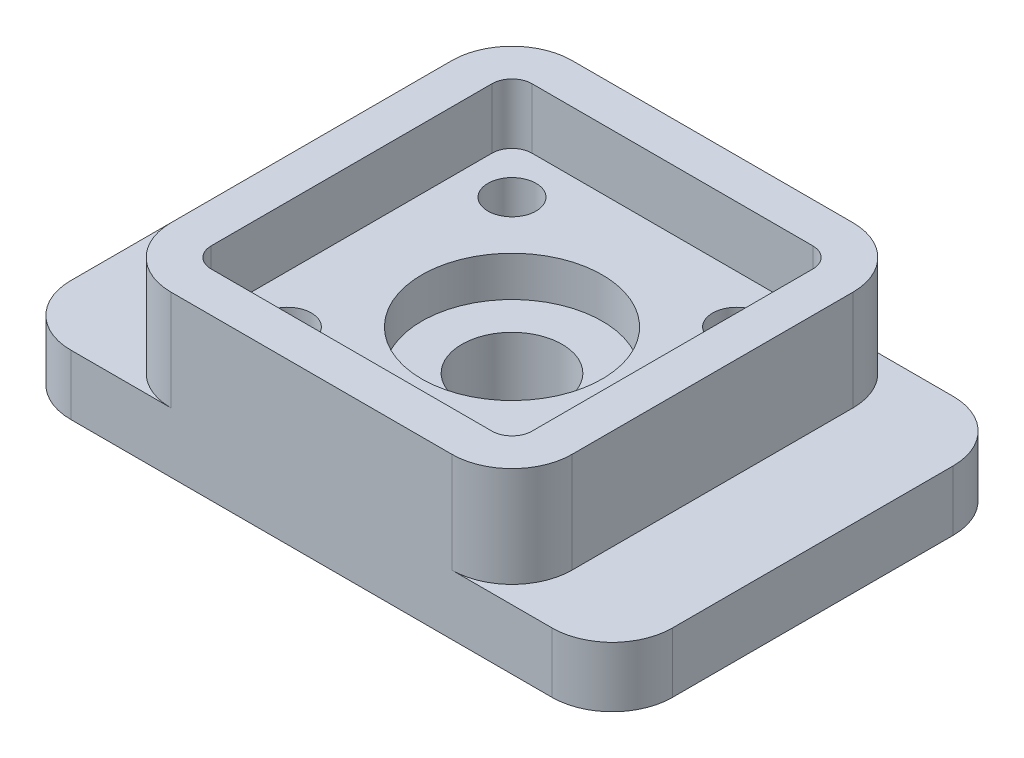
ISO-10303-21;
HEADER;
FILE_DESCRIPTION(('STEP AP214'),'2;1');
FILE_NAME('part.step','',(''),(''),'','','');
FILE_SCHEMA(('AUTOMOTIVE_DESIGN { 1 0 10303 214 1 1 1 1 }'));
ENDSEC;
DATA;
#1=APPLICATION_CONTEXT('core data for automotive mechanical design processes');
#2=APPLICATION_PROTOCOL_DEFINITION('international standard','automotive_design',2000,#1);
#3=PRODUCT_CONTEXT('',#1,'mechanical');
#4=PRODUCT('Part','Part','',(#3));
#5=PRODUCT_RELATED_PRODUCT_CATEGORY('part','',(#4));
#6=PRODUCT_DEFINITION_FORMATION('','',#4);
#7=PRODUCT_DEFINITION_CONTEXT('part definition',#1,'design');
#8=PRODUCT_DEFINITION('design','',#6,#7);
#9=PRODUCT_DEFINITION_SHAPE('','',#8);
#10=(LENGTH_UNIT() NAMED_UNIT(*) SI_UNIT(.MILLI.,.METRE.));
#11=(NAMED_UNIT(*) PLANE_ANGLE_UNIT() SI_UNIT($,.RADIAN.));
#12=(NAMED_UNIT(*) SI_UNIT($,.STERADIAN.) SOLID_ANGLE_UNIT());
#13=UNCERTAINTY_MEASURE_WITH_UNIT(LENGTH_MEASURE(1.E-05),#10,'distance_accuracy_value','');
#14=(GEOMETRIC_REPRESENTATION_CONTEXT(3) GLOBAL_UNCERTAINTY_ASSIGNED_CONTEXT((#13)) GLOBAL_UNIT_ASSIGNED_CONTEXT((#10,
#11,#12)) REPRESENTATION_CONTEXT('',''));
#15=CARTESIAN_POINT('',(0.,0.,0.));
#16=DIRECTION('',(0.,0.,1.));
#17=DIRECTION('',(1.,0.,0.));
#18=AXIS2_PLACEMENT_3D('',#15,#16,#17);
#19=CARTESIAN_POINT('',(-60.,15.,-35.));
#20=DIRECTION('',(0.,1.,0.));
#21=DIRECTION('',(0.,0.,1.));
#22=AXIS2_PLACEMENT_3D('',#19,#20,#21);
#23=PLANE('',#22);
#24=CARTESIAN_POINT('',(0.,15.,0.));
#25=DIRECTION('',(0.,1.,0.));
#26=DIRECTION('',(0.,0.,1.));
#27=AXIS2_PLACEMENT_3D('',#24,#25,#26);
#28=CIRCLE('',#27,22.5);
#29=CARTESIAN_POINT('',(0.,15.,22.5));
#30=VERTEX_POINT('',#29);
#31=EDGE_CURVE('E11',#30,#30,#28,.F.);
#32=ORIENTED_EDGE('',*,*,#31,.F.);
#33=EDGE_LOOP('',(#32));
#34=FACE_BOUND('',#33,.T.);
#35=CARTESIAN_POINT('',(0.,15.,0.));
#36=DIRECTION('',(0.,1.,0.));
#37=DIRECTION('',(0.,0.,1.));
#38=AXIS2_PLACEMENT_3D('',#35,#36,#37);
#39=CIRCLE('',#38,12.5);
#40=CARTESIAN_POINT('',(0.,15.,12.5));
#41=VERTEX_POINT('',#40);
#42=EDGE_CURVE('E342',#41,#41,#39,.T.);
#43=ORIENTED_EDGE('',*,*,#42,.F.);
#44=EDGE_LOOP('',(#43));
#45=FACE_BOUND('',#44,.T.);
#46=ADVANCED_FACE('F35',(#34,#45),#23,.T.);
#47=DIRECTION('',(0.,0.,-1.));
#48=VECTOR('',#47,1.);
#49=CARTESIAN_POINT('',(-50.,15.,-35.));
#50=LINE('',#49,#48);
#51=CARTESIAN_POINT('',(-50.,15.,35.));
#52=VERTEX_POINT('',#51);
#53=CARTESIAN_POINT('',(-50.,15.,-35.));
#54=VERTEX_POINT('',#53);
#55=EDGE_CURVE('E316',#52,#54,#50,.T.);
#56=ORIENTED_EDGE('',*,*,#55,.T.);
#57=CARTESIAN_POINT('',(-35.,15.,-35.));
#58=DIRECTION('',(0.,1.,0.));
#59=DIRECTION('',(0.,0.,1.));
#60=AXIS2_PLACEMENT_3D('',#57,#58,#59);
#61=CIRCLE('',#60,15.);
#62=CARTESIAN_POINT('',(-35.,15.,-50.));
#63=VERTEX_POINT('',#62);
#64=EDGE_CURVE('E301',#54,#63,#61,.F.);
#65=ORIENTED_EDGE('',*,*,#64,.T.);
#66=DIRECTION('',(-1.,0.,0.));
#67=VECTOR('',#66,1.);
#68=CARTESIAN_POINT('',(60.,15.,-50.));
#69=LINE('',#68,#67);
#70=CARTESIAN_POINT('',(-60.,15.,-50.));
#71=VERTEX_POINT('',#70);
#72=EDGE_CURVE('E366',#63,#71,#69,.T.);
#73=ORIENTED_EDGE('',*,*,#72,.T.);
#74=CARTESIAN_POINT('',(-60.,15.,-35.));
#75=DIRECTION('',(0.,1.,0.));
#76=DIRECTION('',(0.,0.,1.));
#77=AXIS2_PLACEMENT_3D('',#74,#75,#76);
#78=CIRCLE('',#77,15.);
#79=CARTESIAN_POINT('',(-75.,15.,-34.9999999999999));
#80=VERTEX_POINT('',#79);
#81=EDGE_CURVE('E348',#71,#80,#78,.T.);
#82=ORIENTED_EDGE('',*,*,#81,.T.);
#83=DIRECTION('',(0.,0.,1.));
#84=VECTOR('',#83,1.);
#85=CARTESIAN_POINT('',(-75.,15.,-34.9999999999999));
#86=LINE('',#85,#84);
#87=CARTESIAN_POINT('',(-75.,15.,35.));
#88=VERTEX_POINT('',#87);
#89=EDGE_CURVE('E351',#80,#88,#86,.T.);
#90=ORIENTED_EDGE('',*,*,#89,.T.);
#91=CARTESIAN_POINT('',(-60.,15.,35.));
#92=DIRECTION('',(0.,1.,0.));
#93=DIRECTION('',(0.,0.,1.));
#94=AXIS2_PLACEMENT_3D('',#91,#92,#93);
#95=CIRCLE('',#94,15.);
#96=CARTESIAN_POINT('',(-60.,15.,50.));
#97=VERTEX_POINT('',#96);
#98=EDGE_CURVE('E354',#88,#97,#95,.T.);
#99=ORIENTED_EDGE('',*,*,#98,.T.);
#100=DIRECTION('',(1.,0.,0.));
#101=VECTOR('',#100,1.);
#102=CARTESIAN_POINT('',(-60.,15.,50.));
#103=LINE('',#102,#101);
#104=CARTESIAN_POINT('',(-35.,15.,50.));
#105=VERTEX_POINT('',#104);
#106=EDGE_CURVE('E357',#97,#105,#103,.T.);
#107=ORIENTED_EDGE('',*,*,#106,.T.);
#108=CARTESIAN_POINT('',(-35.,15.,35.));
#109=DIRECTION('',(0.,1.,0.));
#110=DIRECTION('',(0.,0.,1.));
#111=AXIS2_PLACEMENT_3D('',#108,#109,#110);
#112=CIRCLE('',#111,15.);
#113=EDGE_CURVE('E310',#105,#52,#112,.F.);
#114=ORIENTED_EDGE('',*,*,#113,.T.);
#115=EDGE_LOOP('',(#56,#65,#73,#82,#90,#99,#107,#114));
#116=FACE_BOUND('',#115,.T.);
#117=ADVANCED_FACE('F438',(#116),#23,.T.);
#118=CARTESIAN_POINT('',(60.,15.,-50.));
#119=VERTEX_POINT('',#118);
#120=CARTESIAN_POINT('',(35.,15.,-50.));
#121=VERTEX_POINT('',#120);
#122=EDGE_CURVE('E367',#119,#121,#69,.T.);
#123=ORIENTED_EDGE('',*,*,#122,.T.);
#124=CARTESIAN_POINT('',(35.,15.,-35.));
#125=DIRECTION('',(0.,1.,0.));
#126=DIRECTION('',(0.,0.,1.));
#127=AXIS2_PLACEMENT_3D('',#124,#125,#126);
#128=CIRCLE('',#127,15.);
#129=CARTESIAN_POINT('',(50.,15.,-35.));
#130=VERTEX_POINT('',#129);
#131=EDGE_CURVE('E304',#121,#130,#128,.F.);
#132=ORIENTED_EDGE('',*,*,#131,.T.);
#133=DIRECTION('',(0.,0.,1.));
#134=VECTOR('',#133,1.);
#135=CARTESIAN_POINT('',(50.,15.,-35.));
#136=LINE('',#135,#134);
#137=CARTESIAN_POINT('',(50.,15.,35.));
#138=VERTEX_POINT('',#137);
#139=EDGE_CURVE('E313',#130,#138,#136,.T.);
#140=ORIENTED_EDGE('',*,*,#139,.T.);
#141=CARTESIAN_POINT('',(35.,15.,35.));
#142=DIRECTION('',(0.,1.,0.));
#143=DIRECTION('',(0.,0.,1.));
#144=AXIS2_PLACEMENT_3D('',#141,#142,#143);
#145=CIRCLE('',#144,15.);
#146=CARTESIAN_POINT('',(35.,15.,50.));
#147=VERTEX_POINT('',#146);
#148=EDGE_CURVE('E307',#138,#147,#145,.F.);
#149=ORIENTED_EDGE('',*,*,#148,.T.);
#150=CARTESIAN_POINT('',(60.,15.,50.));
#151=VERTEX_POINT('',#150);
#152=EDGE_CURVE('E356',#147,#151,#103,.T.);
#153=ORIENTED_EDGE('',*,*,#152,.T.);
#154=CARTESIAN_POINT('',(60.,15.,35.));
#155=DIRECTION('',(0.,1.,0.));
#156=DIRECTION('',(0.,0.,1.));
#157=AXIS2_PLACEMENT_3D('',#154,#155,#156);
#158=CIRCLE('',#157,15.);
#159=CARTESIAN_POINT('',(75.,15.,35.));
#160=VERTEX_POINT('',#159);
#161=EDGE_CURVE('E360',#151,#160,#158,.T.);
#162=ORIENTED_EDGE('',*,*,#161,.T.);
#163=DIRECTION('',(0.,0.,-1.));
#164=VECTOR('',#163,1.);
#165=CARTESIAN_POINT('',(75.,15.,35.));
#166=LINE('',#165,#164);
#167=CARTESIAN_POINT('',(75.,15.,-35.));
#168=VERTEX_POINT('',#167);
#169=EDGE_CURVE('E362',#160,#168,#166,.T.);
#170=ORIENTED_EDGE('',*,*,#169,.T.);
#171=CARTESIAN_POINT('',(60.,15.,-35.));
#172=DIRECTION('',(0.,1.,0.));
#173=DIRECTION('',(0.,0.,1.));
#174=AXIS2_PLACEMENT_3D('',#171,#172,#173);
#175=CIRCLE('',#174,15.);
#176=EDGE_CURVE('E364',#168,#119,#175,.T.);
#177=ORIENTED_EDGE('',*,*,#176,.T.);
#178=EDGE_LOOP('',(#123,#132,#140,#149,#153,#162,#170,#177));
#179=FACE_BOUND('',#178,.T.);
#180=ADVANCED_FACE('F445',(#179),#23,.T.);
#181=CARTESIAN_POINT('',(-60.,15.,35.));
#182=DIRECTION('',(0.,-1.,0.));
#183=DIRECTION('',(0.,0.,-1.));
#184=AXIS2_PLACEMENT_3D('',#181,#182,#183);
#185=CYLINDRICAL_SURFACE('',#184,5.);
#186=CARTESIAN_POINT('',(-60.,0.,35.));
#187=DIRECTION('',(0.,1.,0.));
#188=DIRECTION('',(0.,0.,1.));
#189=AXIS2_PLACEMENT_3D('',#186,#187,#188);
#190=CIRCLE('',#189,5.);
#191=CARTESIAN_POINT('',(-60.,0.,40.));
#192=VERTEX_POINT('',#191);
#193=EDGE_CURVE('E322',#192,#192,#190,.T.);
#194=ORIENTED_EDGE('',*,*,#193,.F.);
#195=EDGE_LOOP('',(#194));
#196=FACE_BOUND('',#195,.T.);
#197=CARTESIAN_POINT('',(-60.,13.,35.));
#198=DIRECTION('',(0.,1.,0.));
#199=DIRECTION('',(0.,0.,1.));
#200=AXIS2_PLACEMENT_3D('',#197,#198,#199);
#201=CIRCLE('',#200,5.);
#202=CARTESIAN_POINT('',(-60.,13.,40.));
#203=VERTEX_POINT('',#202);
#204=EDGE_CURVE('E39',#203,#203,#201,.T.);
#205=ORIENTED_EDGE('',*,*,#204,.T.);
#206=EDGE_LOOP('',(#205));
#207=FACE_BOUND('',#206,.T.);
#208=ADVANCED_FACE('F419',(#196,#207),#185,.F.);
#209=CARTESIAN_POINT('',(-60.,15.,-35.));
#210=DIRECTION('',(0.,-1.,0.));
#211=DIRECTION('',(0.,0.,-1.));
#212=AXIS2_PLACEMENT_3D('',#209,#210,#211);
#213=CYLINDRICAL_SURFACE('',#212,5.);
#214=CARTESIAN_POINT('',(-60.,0.,-35.));
#215=DIRECTION('',(0.,1.,0.));
#216=DIRECTION('',(0.,0.,1.));
#217=AXIS2_PLACEMENT_3D('',#214,#215,#216);
#218=CIRCLE('',#217,5.);
#219=CARTESIAN_POINT('',(-60.,0.,-30.));
#220=VERTEX_POINT('',#219);
#221=EDGE_CURVE('E319',#220,#220,#218,.T.);
#222=ORIENTED_EDGE('',*,*,#221,.F.);
#223=EDGE_LOOP('',(#222));
#224=FACE_BOUND('',#223,.T.);
#225=CARTESIAN_POINT('',(-60.,13.,-35.));
#226=DIRECTION('',(0.,1.,0.));
#227=DIRECTION('',(0.,0.,1.));
#228=AXIS2_PLACEMENT_3D('',#225,#226,#227);
#229=CIRCLE('',#228,5.);
#230=CARTESIAN_POINT('',(-60.,13.,-30.));
#231=VERTEX_POINT('',#230);
#232=EDGE_CURVE('E412',#231,#231,#229,.T.);
#233=ORIENTED_EDGE('',*,*,#232,.T.);
#234=EDGE_LOOP('',(#233));
#235=FACE_BOUND('',#234,.T.);
#236=ADVANCED_FACE('F466',(#224,#235),#213,.F.);
#237=CARTESIAN_POINT('',(60.,15.,-35.));
#238=DIRECTION('',(0.,-1.,0.));
#239=DIRECTION('',(0.,0.,-1.));
#240=AXIS2_PLACEMENT_3D('',#237,#238,#239);
#241=CYLINDRICAL_SURFACE('',#240,5.);
#242=CARTESIAN_POINT('',(60.,0.,-35.));
#243=DIRECTION('',(0.,1.,0.));
#244=DIRECTION('',(0.,0.,1.));
#245=AXIS2_PLACEMENT_3D('',#242,#243,#244);
#246=CIRCLE('',#245,5.);
#247=CARTESIAN_POINT('',(60.,0.,-30.));
#248=VERTEX_POINT('',#247);
#249=EDGE_CURVE('E329',#248,#248,#246,.T.);
#250=ORIENTED_EDGE('',*,*,#249,.F.);
#251=EDGE_LOOP('',(#250));
#252=FACE_BOUND('',#251,.T.);
#253=CARTESIAN_POINT('',(60.,13.,-35.));
#254=DIRECTION('',(0.,1.,0.));
#255=DIRECTION('',(0.,0.,1.));
#256=AXIS2_PLACEMENT_3D('',#253,#254,#255);
#257=CIRCLE('',#256,5.);
#258=CARTESIAN_POINT('',(60.,13.,-30.));
#259=VERTEX_POINT('',#258);
#260=EDGE_CURVE('E410',#259,#259,#257,.T.);
#261=ORIENTED_EDGE('',*,*,#260,.T.);
#262=EDGE_LOOP('',(#261));
#263=FACE_BOUND('',#262,.T.);
#264=ADVANCED_FACE('F852',(#252,#263),#241,.F.);
#265=CARTESIAN_POINT('',(60.,15.,35.));
#266=DIRECTION('',(0.,-1.,0.));
#267=DIRECTION('',(0.,0.,-1.));
#268=AXIS2_PLACEMENT_3D('',#265,#266,#267);
#269=CYLINDRICAL_SURFACE('',#268,5.);
#270=CARTESIAN_POINT('',(60.,0.,35.));
#271=DIRECTION('',(0.,1.,0.));
#272=DIRECTION('',(0.,0.,1.));
#273=AXIS2_PLACEMENT_3D('',#270,#271,#272);
#274=CIRCLE('',#273,5.);
#275=CARTESIAN_POINT('',(60.,0.,40.));
#276=VERTEX_POINT('',#275);
#277=EDGE_CURVE('E326',#276,#276,#274,.T.);
#278=ORIENTED_EDGE('',*,*,#277,.F.);
#279=EDGE_LOOP('',(#278));
#280=FACE_BOUND('',#279,.T.);
#281=CARTESIAN_POINT('',(60.,13.,35.));
#282=DIRECTION('',(0.,1.,0.));
#283=DIRECTION('',(0.,0.,1.));
#284=AXIS2_PLACEMENT_3D('',#281,#282,#283);
#285=CIRCLE('',#284,5.);
#286=CARTESIAN_POINT('',(60.,13.,40.));
#287=VERTEX_POINT('',#286);
#288=EDGE_CURVE('E323',#287,#287,#285,.T.);
#289=ORIENTED_EDGE('',*,*,#288,.T.);
#290=EDGE_LOOP('',(#289));
#291=FACE_BOUND('',#290,.T.);
#292=ADVANCED_FACE('F585',(#280,#291),#269,.F.);
#293=CARTESIAN_POINT('',(-60.,0.,-35.));
#294=DIRECTION('',(0.,1.,0.));
#295=DIRECTION('',(0.,0.,1.));
#296=AXIS2_PLACEMENT_3D('',#293,#294,#295);
#297=PLANE('',#296);
#298=CARTESIAN_POINT('',(28.,0.,-28.));
#299=DIRECTION('',(0.,1.,0.));
#300=DIRECTION('',(0.,0.,1.));
#301=AXIS2_PLACEMENT_3D('',#298,#299,#300);
#302=CIRCLE('',#301,5.99999999999999);
#303=CARTESIAN_POINT('',(28.,0.,-22.));
#304=VERTEX_POINT('',#303);
#305=EDGE_CURVE('E332',#304,#304,#302,.T.);
#306=ORIENTED_EDGE('',*,*,#305,.T.);
#307=EDGE_LOOP('',(#306));
#308=FACE_BOUND('',#307,.T.);
#309=CARTESIAN_POINT('',(-28.,0.,-28.));
#310=DIRECTION('',(0.,1.,0.));
#311=DIRECTION('',(0.,0.,1.));
#312=AXIS2_PLACEMENT_3D('',#309,#310,#311);
#313=CIRCLE('',#312,5.99999999999999);
#314=CARTESIAN_POINT('',(-28.,0.,-22.));
#315=VERTEX_POINT('',#314);
#316=EDGE_CURVE('E335',#315,#315,#313,.T.);
#317=ORIENTED_EDGE('',*,*,#316,.T.);
#318=EDGE_LOOP('',(#317));
#319=FACE_BOUND('',#318,.T.);
#320=CARTESIAN_POINT('',(-28.,0.,28.));
#321=DIRECTION('',(0.,1.,0.));
#322=DIRECTION('',(0.,0.,1.));
#323=AXIS2_PLACEMENT_3D('',#320,#321,#322);
#324=CIRCLE('',#323,5.99999999999999);
#325=CARTESIAN_POINT('',(-28.,0.,34.));
#326=VERTEX_POINT('',#325);
#327=EDGE_CURVE('E338',#326,#326,#324,.T.);
#328=ORIENTED_EDGE('',*,*,#327,.T.);
#329=EDGE_LOOP('',(#328));
#330=FACE_BOUND('',#329,.T.);
#331=CARTESIAN_POINT('',(0.,0.,0.));
#332=DIRECTION('',(0.,1.,0.));
#333=DIRECTION('',(0.,0.,1.));
#334=AXIS2_PLACEMENT_3D('',#331,#332,#333);
#335=CIRCLE('',#334,12.5);
#336=CARTESIAN_POINT('',(0.,0.,12.5));
#337=VERTEX_POINT('',#336);
#338=EDGE_CURVE('E341',#337,#337,#335,.T.);
#339=ORIENTED_EDGE('',*,*,#338,.T.);
#340=EDGE_LOOP('',(#339));
#341=FACE_BOUND('',#340,.T.);
#342=CARTESIAN_POINT('',(-60.,0.,-35.));
#343=DIRECTION('',(0.,1.,0.));
#344=DIRECTION('',(0.,0.,1.));
#345=AXIS2_PLACEMENT_3D('',#342,#343,#344);
#346=CIRCLE('',#345,15.);
#347=CARTESIAN_POINT('',(-60.,0.,-50.));
#348=VERTEX_POINT('',#347);
#349=CARTESIAN_POINT('',(-75.,0.,-34.9999999999999));
#350=VERTEX_POINT('',#349);
#351=EDGE_CURVE('E345',#348,#350,#346,.T.);
#352=ORIENTED_EDGE('',*,*,#351,.F.);
#353=DIRECTION('',(-1.,0.,0.));
#354=VECTOR('',#353,1.);
#355=CARTESIAN_POINT('',(60.,0.,-50.));
#356=LINE('',#355,#354);
#357=CARTESIAN_POINT('',(60.,0.,-50.));
#358=VERTEX_POINT('',#357);
#359=EDGE_CURVE('E352',#358,#348,#356,.T.);
#360=ORIENTED_EDGE('',*,*,#359,.F.);
#361=CARTESIAN_POINT('',(60.,0.,-35.));
#362=DIRECTION('',(0.,1.,0.));
#363=DIRECTION('',(0.,0.,1.));
#364=AXIS2_PLACEMENT_3D('',#361,#362,#363);
#365=CIRCLE('',#364,15.);
#366=CARTESIAN_POINT('',(75.,0.,-35.));
#367=VERTEX_POINT('',#366);
#368=EDGE_CURVE('E383',#367,#358,#365,.T.);
#369=ORIENTED_EDGE('',*,*,#368,.F.);
#370=DIRECTION('',(0.,0.,-1.));
#371=VECTOR('',#370,1.);
#372=CARTESIAN_POINT('',(75.,0.,35.));
#373=LINE('',#372,#371);
#374=CARTESIAN_POINT('',(75.,0.,35.));
#375=VERTEX_POINT('',#374);
#376=EDGE_CURVE('E381',#375,#367,#373,.T.);
#377=ORIENTED_EDGE('',*,*,#376,.F.);
#378=CARTESIAN_POINT('',(60.,0.,35.));
#379=DIRECTION('',(0.,1.,0.));
#380=DIRECTION('',(0.,0.,1.));
#381=AXIS2_PLACEMENT_3D('',#378,#379,#380);
#382=CIRCLE('',#381,15.);
#383=CARTESIAN_POINT('',(60.,0.,50.));
#384=VERTEX_POINT('',#383);
#385=EDGE_CURVE('E379',#384,#375,#382,.T.);
#386=ORIENTED_EDGE('',*,*,#385,.F.);
#387=DIRECTION('',(1.,0.,0.));
#388=VECTOR('',#387,1.);
#389=CARTESIAN_POINT('',(-60.,0.,50.));
#390=LINE('',#389,#388);
#391=CARTESIAN_POINT('',(-60.,0.,50.));
#392=VERTEX_POINT('',#391);
#393=EDGE_CURVE('E377',#392,#384,#390,.T.);
#394=ORIENTED_EDGE('',*,*,#393,.F.);
#395=CARTESIAN_POINT('',(-60.,0.,35.));
#396=DIRECTION('',(0.,1.,0.));
#397=DIRECTION('',(0.,0.,1.));
#398=AXIS2_PLACEMENT_3D('',#395,#396,#397);
#399=CIRCLE('',#398,15.);
#400=CARTESIAN_POINT('',(-75.,0.,35.));
#401=VERTEX_POINT('',#400);
#402=EDGE_CURVE('E375',#401,#392,#399,.T.);
#403=ORIENTED_EDGE('',*,*,#402,.F.);
#404=DIRECTION('',(0.,0.,1.));
#405=VECTOR('',#404,1.);
#406=CARTESIAN_POINT('',(-75.,0.,-34.9999999999999));
#407=LINE('',#406,#405);
#408=EDGE_CURVE('E373',#350,#401,#407,.T.);
#409=ORIENTED_EDGE('',*,*,#408,.F.);
#410=EDGE_LOOP('',(#352,#360,#369,#377,#386,#394,#403,#409));
#411=FACE_BOUND('',#410,.T.);
#412=ORIENTED_EDGE('',*,*,#249,.T.);
#413=EDGE_LOOP('',(#412));
#414=FACE_BOUND('',#413,.T.);
#415=ORIENTED_EDGE('',*,*,#277,.T.);
#416=EDGE_LOOP('',(#415));
#417=FACE_BOUND('',#416,.T.);
#418=ORIENTED_EDGE('',*,*,#193,.T.);
#419=EDGE_LOOP('',(#418));
#420=FACE_BOUND('',#419,.T.);
#421=ORIENTED_EDGE('',*,*,#221,.T.);
#422=EDGE_LOOP('',(#421));
#423=FACE_BOUND('',#422,.T.);
#424=ADVANCED_FACE('F509',(#308,#319,#330,#341,#411,#414,#417,#420,#423),#297,.F.);
#425=CARTESIAN_POINT('',(-60.,15.,-35.));
#426=DIRECTION('',(0.,-1.,0.));
#427=DIRECTION('',(0.,0.,-1.));
#428=AXIS2_PLACEMENT_3D('',#425,#426,#427);
#429=CYLINDRICAL_SURFACE('',#428,15.);
#430=ORIENTED_EDGE('',*,*,#351,.T.);
#431=DIRECTION('',(0.,-1.,0.));
#432=VECTOR('',#431,1.);
#433=CARTESIAN_POINT('',(-75.,15.,-34.9999999999999));
#434=LINE('',#433,#432);
#435=EDGE_CURVE('E231',#80,#350,#434,.T.);
#436=ORIENTED_EDGE('',*,*,#435,.F.);
#437=ORIENTED_EDGE('',*,*,#81,.F.);
#438=DIRECTION('',(0.,-1.,0.));
#439=VECTOR('',#438,1.);
#440=CARTESIAN_POINT('',(-60.,15.,-50.));
#441=LINE('',#440,#439);
#442=EDGE_CURVE('E370',#71,#348,#441,.T.);
#443=ORIENTED_EDGE('',*,*,#442,.T.);
#444=EDGE_LOOP('',(#430,#436,#437,#443));
#445=FACE_BOUND('',#444,.T.);
#446=ADVANCED_FACE('F37',(#445),#429,.T.);
#447=CARTESIAN_POINT('',(-75.,15.,-34.9999999999999));
#448=DIRECTION('',(1.,0.,0.));
#449=DIRECTION('',(0.,0.,-1.));
#450=AXIS2_PLACEMENT_3D('',#447,#448,#449);
#451=PLANE('',#450);
#452=ORIENTED_EDGE('',*,*,#408,.T.);
#453=DIRECTION('',(0.,-1.,0.));
#454=VECTOR('',#453,1.);
#455=CARTESIAN_POINT('',(-75.,15.,35.));
#456=LINE('',#455,#454);
#457=EDGE_CURVE('E403',#88,#401,#456,.T.);
#458=ORIENTED_EDGE('',*,*,#457,.F.);
#459=ORIENTED_EDGE('',*,*,#89,.F.);
#460=ORIENTED_EDGE('',*,*,#435,.T.);
#461=EDGE_LOOP('',(#452,#458,#459,#460));
#462=FACE_BOUND('',#461,.T.);
#463=ADVANCED_FACE('F916',(#462),#451,.F.);
#464=CARTESIAN_POINT('',(-60.,15.,35.));
#465=DIRECTION('',(0.,-1.,0.));
#466=DIRECTION('',(0.,0.,-1.));
#467=AXIS2_PLACEMENT_3D('',#464,#465,#466);
#468=CYLINDRICAL_SURFACE('',#467,15.);
#469=ORIENTED_EDGE('',*,*,#402,.T.);
#470=DIRECTION('',(0.,-1.,0.));
#471=VECTOR('',#470,1.);
#472=CARTESIAN_POINT('',(-60.,15.,50.));
#473=LINE('',#472,#471);
#474=EDGE_CURVE('E400',#97,#392,#473,.T.);
#475=ORIENTED_EDGE('',*,*,#474,.F.);
#476=ORIENTED_EDGE('',*,*,#98,.F.);
#477=ORIENTED_EDGE('',*,*,#457,.T.);
#478=EDGE_LOOP('',(#469,#475,#476,#477));
#479=FACE_BOUND('',#478,.T.);
#480=ADVANCED_FACE('F799',(#479),#468,.T.);
#481=CARTESIAN_POINT('',(-60.,15.,50.));
#482=DIRECTION('',(0.,0.,-1.));
#483=DIRECTION('',(-1.,0.,0.));
#484=AXIS2_PLACEMENT_3D('',#481,#482,#483);
#485=PLANE('',#484);
#486=ORIENTED_EDGE('',*,*,#393,.T.);
#487=DIRECTION('',(0.,-1.,0.));
#488=VECTOR('',#487,1.);
#489=CARTESIAN_POINT('',(60.,15.,50.));
#490=LINE('',#489,#488);
#491=EDGE_CURVE('E397',#151,#384,#490,.T.);
#492=ORIENTED_EDGE('',*,*,#491,.F.);
#493=ORIENTED_EDGE('',*,*,#152,.F.);
#494=DIRECTION('',(0.,-1.,0.));
#495=VECTOR('',#494,1.);
#496=CARTESIAN_POINT('',(35.,40.,50.));
#497=LINE('',#496,#495);
#498=CARTESIAN_POINT('',(35.,40.,50.));
#499=VERTEX_POINT('',#498);
#500=EDGE_CURVE('E285',#499,#147,#497,.T.);
#501=ORIENTED_EDGE('',*,*,#500,.F.);
#502=DIRECTION('',(1.,0.,0.));
#503=VECTOR('',#502,1.);
#504=CARTESIAN_POINT('',(-35.,40.,50.));
#505=LINE('',#504,#503);
#506=CARTESIAN_POINT('',(-35.,40.,50.));
#507=VERTEX_POINT('',#506);
#508=EDGE_CURVE('E274',#507,#499,#505,.T.);
#509=ORIENTED_EDGE('',*,*,#508,.F.);
#510=DIRECTION('',(0.,-1.,0.));
#511=VECTOR('',#510,1.);
#512=CARTESIAN_POINT('',(-35.,40.,50.));
#513=LINE('',#512,#511);
#514=EDGE_CURVE('E287',#507,#105,#513,.T.);
#515=ORIENTED_EDGE('',*,*,#514,.T.);
#516=ORIENTED_EDGE('',*,*,#106,.F.);
#517=ORIENTED_EDGE('',*,*,#474,.T.);
#518=EDGE_LOOP('',(#486,#492,#493,#501,#509,#515,#516,#517));
#519=FACE_BOUND('',#518,.T.);
#520=ADVANCED_FACE('F490',(#519),#485,.F.);
#521=CARTESIAN_POINT('',(60.,15.,35.));
#522=DIRECTION('',(0.,-1.,0.));
#523=DIRECTION('',(0.,0.,-1.));
#524=AXIS2_PLACEMENT_3D('',#521,#522,#523);
#525=CYLINDRICAL_SURFACE('',#524,15.);
#526=ORIENTED_EDGE('',*,*,#385,.T.);
#527=DIRECTION('',(0.,-1.,0.));
#528=VECTOR('',#527,1.);
#529=CARTESIAN_POINT('',(75.,15.,35.));
#530=LINE('',#529,#528);
#531=EDGE_CURVE('E394',#160,#375,#530,.T.);
#532=ORIENTED_EDGE('',*,*,#531,.F.);
#533=ORIENTED_EDGE('',*,*,#161,.F.);
#534=ORIENTED_EDGE('',*,*,#491,.T.);
#535=EDGE_LOOP('',(#526,#532,#533,#534));
#536=FACE_BOUND('',#535,.T.);
#537=ADVANCED_FACE('F498',(#536),#525,.T.);
#538=CARTESIAN_POINT('',(75.,15.,35.));
#539=DIRECTION('',(-1.,0.,0.));
#540=DIRECTION('',(0.,0.,1.));
#541=AXIS2_PLACEMENT_3D('',#538,#539,#540);
#542=PLANE('',#541);
#543=ORIENTED_EDGE('',*,*,#376,.T.);
#544=DIRECTION('',(0.,-1.,0.));
#545=VECTOR('',#544,1.);
#546=CARTESIAN_POINT('',(75.,15.,-35.));
#547=LINE('',#546,#545);
#548=EDGE_CURVE('E391',#168,#367,#547,.T.);
#549=ORIENTED_EDGE('',*,*,#548,.F.);
#550=ORIENTED_EDGE('',*,*,#169,.F.);
#551=ORIENTED_EDGE('',*,*,#531,.T.);
#552=EDGE_LOOP('',(#543,#549,#550,#551));
#553=FACE_BOUND('',#552,.T.);
#554=ADVANCED_FACE('F502',(#553),#542,.F.);
#555=CARTESIAN_POINT('',(60.,15.,-35.));
#556=DIRECTION('',(0.,-1.,0.));
#557=DIRECTION('',(0.,0.,-1.));
#558=AXIS2_PLACEMENT_3D('',#555,#556,#557);
#559=CYLINDRICAL_SURFACE('',#558,15.);
#560=ORIENTED_EDGE('',*,*,#368,.T.);
#561=DIRECTION('',(0.,-1.,0.));
#562=VECTOR('',#561,1.);
#563=CARTESIAN_POINT('',(60.,15.,-50.));
#564=LINE('',#563,#562);
#565=EDGE_CURVE('E388',#119,#358,#564,.T.);
#566=ORIENTED_EDGE('',*,*,#565,.F.);
#567=ORIENTED_EDGE('',*,*,#176,.F.);
#568=ORIENTED_EDGE('',*,*,#548,.T.);
#569=EDGE_LOOP('',(#560,#566,#567,#568));
#570=FACE_BOUND('',#569,.T.);
#571=ADVANCED_FACE('F506',(#570),#559,.T.);
#572=CARTESIAN_POINT('',(60.,15.,-50.));
#573=DIRECTION('',(0.,0.,1.));
#574=DIRECTION('',(1.,0.,0.));
#575=AXIS2_PLACEMENT_3D('',#572,#573,#574);
#576=PLANE('',#575);
#577=ORIENTED_EDGE('',*,*,#359,.T.);
#578=ORIENTED_EDGE('',*,*,#442,.F.);
#579=ORIENTED_EDGE('',*,*,#72,.F.);
#580=DIRECTION('',(0.,-1.,0.));
#581=VECTOR('',#580,1.);
#582=CARTESIAN_POINT('',(-35.,40.,-50.));
#583=LINE('',#582,#581);
#584=CARTESIAN_POINT('',(-35.,40.,-50.));
#585=VERTEX_POINT('',#584);
#586=EDGE_CURVE('E296',#585,#63,#583,.T.);
#587=ORIENTED_EDGE('',*,*,#586,.F.);
#588=DIRECTION('',(-1.,0.,0.));
#589=VECTOR('',#588,1.);
#590=CARTESIAN_POINT('',(35.,40.,-50.));
#591=LINE('',#590,#589);
#592=CARTESIAN_POINT('',(35.,40.,-50.));
#593=VERTEX_POINT('',#592);
#594=EDGE_CURVE('E266',#593,#585,#591,.T.);
#595=ORIENTED_EDGE('',*,*,#594,.F.);
#596=DIRECTION('',(0.,-1.,0.));
#597=VECTOR('',#596,1.);
#598=CARTESIAN_POINT('',(35.,40.,-50.));
#599=LINE('',#598,#597);
#600=EDGE_CURVE('E298',#593,#121,#599,.T.);
#601=ORIENTED_EDGE('',*,*,#600,.T.);
#602=ORIENTED_EDGE('',*,*,#122,.F.);
#603=ORIENTED_EDGE('',*,*,#565,.T.);
#604=EDGE_LOOP('',(#577,#578,#579,#587,#595,#601,#602,#603));
#605=FACE_BOUND('',#604,.T.);
#606=ADVANCED_FACE('F473',(#605),#576,.F.);
#607=CARTESIAN_POINT('',(0.,15.,0.));
#608=DIRECTION('',(0.,-1.,0.));
#609=DIRECTION('',(0.,0.,-1.));
#610=AXIS2_PLACEMENT_3D('',#607,#608,#609);
#611=CYLINDRICAL_SURFACE('',#610,12.5);
#612=ORIENTED_EDGE('',*,*,#42,.T.);
#613=EDGE_LOOP('',(#612));
#614=FACE_BOUND('',#613,.T.);
#615=ORIENTED_EDGE('',*,*,#338,.F.);
#616=EDGE_LOOP('',(#615));
#617=FACE_BOUND('',#616,.T.);
#618=ADVANCED_FACE('F599',(#614,#617),#611,.F.);
#619=CARTESIAN_POINT('',(-28.,15.,28.));
#620=DIRECTION('',(0.,-1.,0.));
#621=DIRECTION('',(0.,0.,-1.));
#622=AXIS2_PLACEMENT_3D('',#619,#620,#621);
#623=CYLINDRICAL_SURFACE('',#622,5.99999999999999);
#624=ORIENTED_EDGE('',*,*,#327,.F.);
#625=EDGE_LOOP('',(#624));
#626=FACE_BOUND('',#625,.T.);
#627=CARTESIAN_POINT('',(-28.,25.,28.));
#628=DIRECTION('',(0.,1.,0.));
#629=DIRECTION('',(0.,0.,1.));
#630=AXIS2_PLACEMENT_3D('',#627,#628,#629);
#631=CIRCLE('',#630,5.99999999999999);
#632=CARTESIAN_POINT('',(-28.,25.,34.));
#633=VERTEX_POINT('',#632);
#634=EDGE_CURVE('E978',#633,#633,#631,.T.);
#635=ORIENTED_EDGE('',*,*,#634,.T.);
#636=EDGE_LOOP('',(#635));
#637=FACE_BOUND('',#636,.T.);
#638=ADVANCED_FACE('F594',(#626,#637),#623,.F.);
#639=CARTESIAN_POINT('',(-28.,15.,-28.));
#640=DIRECTION('',(0.,-1.,0.));
#641=DIRECTION('',(0.,0.,-1.));
#642=AXIS2_PLACEMENT_3D('',#639,#640,#641);
#643=CYLINDRICAL_SURFACE('',#642,5.99999999999999);
#644=ORIENTED_EDGE('',*,*,#316,.F.);
#645=EDGE_LOOP('',(#644));
#646=FACE_BOUND('',#645,.T.);
#647=CARTESIAN_POINT('',(-28.,25.,-28.));
#648=DIRECTION('',(0.,1.,0.));
#649=DIRECTION('',(0.,0.,1.));
#650=AXIS2_PLACEMENT_3D('',#647,#648,#649);
#651=CIRCLE('',#650,5.99999999999999);
#652=CARTESIAN_POINT('',(-28.,25.,-22.));
#653=VERTEX_POINT('',#652);
#654=EDGE_CURVE('E981',#653,#653,#651,.T.);
#655=ORIENTED_EDGE('',*,*,#654,.T.);
#656=EDGE_LOOP('',(#655));
#657=FACE_BOUND('',#656,.T.);
#658=ADVANCED_FACE('F598',(#646,#657),#643,.F.);
#659=CARTESIAN_POINT('',(28.,15.,-28.));
#660=DIRECTION('',(0.,-1.,0.));
#661=DIRECTION('',(0.,0.,-1.));
#662=AXIS2_PLACEMENT_3D('',#659,#660,#661);
#663=CYLINDRICAL_SURFACE('',#662,5.99999999999999);
#664=ORIENTED_EDGE('',*,*,#305,.F.);
#665=EDGE_LOOP('',(#664));
#666=FACE_BOUND('',#665,.T.);
#667=CARTESIAN_POINT('',(28.,25.,-28.));
#668=DIRECTION('',(0.,1.,0.));
#669=DIRECTION('',(0.,0.,1.));
#670=AXIS2_PLACEMENT_3D('',#667,#668,#669);
#671=CIRCLE('',#670,5.99999999999999);
#672=CARTESIAN_POINT('',(28.,25.,-22.));
#673=VERTEX_POINT('',#672);
#674=EDGE_CURVE('E953',#673,#673,#671,.T.);
#675=ORIENTED_EDGE('',*,*,#674,.T.);
#676=EDGE_LOOP('',(#675));
#677=FACE_BOUND('',#676,.T.);
#678=ADVANCED_FACE('F611',(#666,#677),#663,.F.);
#679=CARTESIAN_POINT('',(60.,13.,35.));
#680=DIRECTION('',(0.,1.,0.));
#681=DIRECTION('',(0.,0.,1.));
#682=AXIS2_PLACEMENT_3D('',#679,#680,#681);
#683=PLANE('',#682);
#684=ORIENTED_EDGE('',*,*,#288,.F.);
#685=EDGE_LOOP('',(#684));
#686=FACE_BOUND('',#685,.T.);
#687=ADVANCED_FACE('F622',(#686),#683,.F.);
#688=CARTESIAN_POINT('',(60.,13.,-35.));
#689=DIRECTION('',(0.,1.,0.));
#690=DIRECTION('',(0.,0.,1.));
#691=AXIS2_PLACEMENT_3D('',#688,#689,#690);
#692=PLANE('',#691);
#693=ORIENTED_EDGE('',*,*,#260,.F.);
#694=EDGE_LOOP('',(#693));
#695=FACE_BOUND('',#694,.T.);
#696=ADVANCED_FACE('F433',(#695),#692,.F.);
#697=CARTESIAN_POINT('',(-60.,13.,-35.));
#698=DIRECTION('',(0.,1.,0.));
#699=DIRECTION('',(0.,0.,1.));
#700=AXIS2_PLACEMENT_3D('',#697,#698,#699);
#701=PLANE('',#700);
#702=ORIENTED_EDGE('',*,*,#232,.F.);
#703=EDGE_LOOP('',(#702));
#704=FACE_BOUND('',#703,.T.);
#705=ADVANCED_FACE('F424',(#704),#701,.F.);
#706=CARTESIAN_POINT('',(-60.,13.,35.));
#707=DIRECTION('',(0.,1.,0.));
#708=DIRECTION('',(0.,0.,1.));
#709=AXIS2_PLACEMENT_3D('',#706,#707,#708);
#710=PLANE('',#709);
#711=ORIENTED_EDGE('',*,*,#204,.F.);
#712=EDGE_LOOP('',(#711));
#713=FACE_BOUND('',#712,.T.);
#714=ADVANCED_FACE('F421',(#713),#710,.F.);
#715=CARTESIAN_POINT('',(35.,40.,-35.));
#716=DIRECTION('',(0.,1.,0.));
#717=DIRECTION('',(0.,0.,1.));
#718=AXIS2_PLACEMENT_3D('',#715,#716,#717);
#719=PLANE('',#718);
#720=CARTESIAN_POINT('',(35.,40.,-35.));
#721=DIRECTION('',(0.,1.,0.));
#722=DIRECTION('',(0.,0.,1.));
#723=AXIS2_PLACEMENT_3D('',#720,#721,#722);
#724=CIRCLE('',#723,15.);
#725=CARTESIAN_POINT('',(50.,40.,-35.));
#726=VERTEX_POINT('',#725);
#727=EDGE_CURVE('E263',#726,#593,#724,.T.);
#728=ORIENTED_EDGE('',*,*,#727,.T.);
#729=ORIENTED_EDGE('',*,*,#594,.T.);
#730=CARTESIAN_POINT('',(-35.,40.,-35.));
#731=DIRECTION('',(0.,1.,0.));
#732=DIRECTION('',(0.,0.,1.));
#733=AXIS2_PLACEMENT_3D('',#730,#731,#732);
#734=CIRCLE('',#733,15.);
#735=CARTESIAN_POINT('',(-50.,40.,-35.));
#736=VERTEX_POINT('',#735);
#737=EDGE_CURVE('E268',#585,#736,#734,.T.);
#738=ORIENTED_EDGE('',*,*,#737,.T.);
#739=DIRECTION('',(0.,0.,1.));
#740=VECTOR('',#739,1.);
#741=CARTESIAN_POINT('',(-50.,40.,-35.));
#742=LINE('',#741,#740);
#743=CARTESIAN_POINT('',(-50.,40.,35.));
#744=VERTEX_POINT('',#743);
#745=EDGE_CURVE('E270',#736,#744,#742,.T.);
#746=ORIENTED_EDGE('',*,*,#745,.T.);
#747=CARTESIAN_POINT('',(-35.,40.,35.));
#748=DIRECTION('',(0.,1.,0.));
#749=DIRECTION('',(0.,0.,1.));
#750=AXIS2_PLACEMENT_3D('',#747,#748,#749);
#751=CIRCLE('',#750,15.);
#752=EDGE_CURVE('E272',#744,#507,#751,.T.);
#753=ORIENTED_EDGE('',*,*,#752,.T.);
#754=ORIENTED_EDGE('',*,*,#508,.T.);
#755=CARTESIAN_POINT('',(35.,40.,35.));
#756=DIRECTION('',(0.,1.,0.));
#757=DIRECTION('',(0.,0.,1.));
#758=AXIS2_PLACEMENT_3D('',#755,#756,#757);
#759=CIRCLE('',#758,15.);
#760=CARTESIAN_POINT('',(50.,40.,35.));
#761=VERTEX_POINT('',#760);
#762=EDGE_CURVE('E276',#499,#761,#759,.T.);
#763=ORIENTED_EDGE('',*,*,#762,.T.);
#764=DIRECTION('',(0.,0.,-1.));
#765=VECTOR('',#764,1.);
#766=CARTESIAN_POINT('',(50.,40.,35.));
#767=LINE('',#766,#765);
#768=EDGE_CURVE('E278',#761,#726,#767,.T.);
#769=ORIENTED_EDGE('',*,*,#768,.T.);
#770=EDGE_LOOP('',(#728,#729,#738,#746,#753,#754,#763,#769));
#771=FACE_BOUND('',#770,.T.);
#772=DIRECTION('',(-1.,0.,0.));
#773=VECTOR('',#772,1.);
#774=CARTESIAN_POINT('',(35.,40.,-40.));
#775=LINE('',#774,#773);
#776=CARTESIAN_POINT('',(35.,40.,-40.));
#777=VERTEX_POINT('',#776);
#778=CARTESIAN_POINT('',(-35.,40.,-40.));
#779=VERTEX_POINT('',#778);
#780=EDGE_CURVE('E234',#777,#779,#775,.T.);
#781=ORIENTED_EDGE('',*,*,#780,.F.);
#782=CARTESIAN_POINT('',(35.,40.,-35.));
#783=DIRECTION('',(0.,1.,0.));
#784=DIRECTION('',(0.,0.,1.));
#785=AXIS2_PLACEMENT_3D('',#782,#783,#784);
#786=CIRCLE('',#785,4.99999999999998);
#787=CARTESIAN_POINT('',(40.,40.,-35.));
#788=VERTEX_POINT('',#787);
#789=EDGE_CURVE('E229',#788,#777,#786,.T.);
#790=ORIENTED_EDGE('',*,*,#789,.F.);
#791=DIRECTION('',(0.,0.,-1.));
#792=VECTOR('',#791,1.);
#793=CARTESIAN_POINT('',(40.,40.,35.));
#794=LINE('',#793,#792);
#795=CARTESIAN_POINT('',(40.,40.,35.));
#796=VERTEX_POINT('',#795);
#797=EDGE_CURVE('E207',#796,#788,#794,.T.);
#798=ORIENTED_EDGE('',*,*,#797,.F.);
#799=CARTESIAN_POINT('',(35.,40.,35.));
#800=DIRECTION('',(0.,1.,0.));
#801=DIRECTION('',(0.,0.,1.));
#802=AXIS2_PLACEMENT_3D('',#799,#800,#801);
#803=CIRCLE('',#802,4.99999999999998);
#804=CARTESIAN_POINT('',(35.,40.,40.));
#805=VERTEX_POINT('',#804);
#806=EDGE_CURVE('E244',#805,#796,#803,.T.);
#807=ORIENTED_EDGE('',*,*,#806,.F.);
#808=DIRECTION('',(1.,0.,0.));
#809=VECTOR('',#808,1.);
#810=CARTESIAN_POINT('',(-35.,40.,40.));
#811=LINE('',#810,#809);
#812=CARTESIAN_POINT('',(-35.,40.,40.));
#813=VERTEX_POINT('',#812);
#814=EDGE_CURVE('E242',#813,#805,#811,.T.);
#815=ORIENTED_EDGE('',*,*,#814,.F.);
#816=CARTESIAN_POINT('',(-35.,40.,35.));
#817=DIRECTION('',(0.,1.,0.));
#818=DIRECTION('',(0.,0.,1.));
#819=AXIS2_PLACEMENT_3D('',#816,#817,#818);
#820=CIRCLE('',#819,4.99999999999998);
#821=CARTESIAN_POINT('',(-40.,40.,35.));
#822=VERTEX_POINT('',#821);
#823=EDGE_CURVE('E240',#822,#813,#820,.T.);
#824=ORIENTED_EDGE('',*,*,#823,.F.);
#825=DIRECTION('',(0.,0.,1.));
#826=VECTOR('',#825,1.);
#827=CARTESIAN_POINT('',(-40.,40.,-35.));
#828=LINE('',#827,#826);
#829=CARTESIAN_POINT('',(-40.,40.,-35.));
#830=VERTEX_POINT('',#829);
#831=EDGE_CURVE('E238',#830,#822,#828,.T.);
#832=ORIENTED_EDGE('',*,*,#831,.F.);
#833=CARTESIAN_POINT('',(-35.,40.,-35.));
#834=DIRECTION('',(0.,1.,0.));
#835=DIRECTION('',(0.,0.,1.));
#836=AXIS2_PLACEMENT_3D('',#833,#834,#835);
#837=CIRCLE('',#836,4.99999999999997);
#838=EDGE_CURVE('E236',#779,#830,#837,.T.);
#839=ORIENTED_EDGE('',*,*,#838,.F.);
#840=EDGE_LOOP('',(#781,#790,#798,#807,#815,#824,#832,#839));
#841=FACE_BOUND('',#840,.T.);
#842=ADVANCED_FACE('F423',(#771,#841),#719,.T.);
#843=CARTESIAN_POINT('',(35.,40.,-35.));
#844=DIRECTION('',(0.,-1.,0.));
#845=DIRECTION('',(0.,0.,-1.));
#846=AXIS2_PLACEMENT_3D('',#843,#844,#845);
#847=CYLINDRICAL_SURFACE('',#846,15.);
#848=ORIENTED_EDGE('',*,*,#131,.F.);
#849=ORIENTED_EDGE('',*,*,#600,.F.);
#850=ORIENTED_EDGE('',*,*,#727,.F.);
#851=DIRECTION('',(0.,-1.,0.));
#852=VECTOR('',#851,1.);
#853=CARTESIAN_POINT('',(50.,40.,-35.));
#854=LINE('',#853,#852);
#855=EDGE_CURVE('E280',#726,#130,#854,.T.);
#856=ORIENTED_EDGE('',*,*,#855,.T.);
#857=EDGE_LOOP('',(#848,#849,#850,#856));
#858=FACE_BOUND('',#857,.T.);
#859=ADVANCED_FACE('F430',(#858),#847,.T.);
#860=CARTESIAN_POINT('',(-35.,40.,-35.));
#861=DIRECTION('',(0.,-1.,0.));
#862=DIRECTION('',(0.,0.,-1.));
#863=AXIS2_PLACEMENT_3D('',#860,#861,#862);
#864=CYLINDRICAL_SURFACE('',#863,15.);
#865=ORIENTED_EDGE('',*,*,#64,.F.);
#866=DIRECTION('',(0.,-1.,0.));
#867=VECTOR('',#866,1.);
#868=CARTESIAN_POINT('',(-50.,40.,-35.));
#869=LINE('',#868,#867);
#870=EDGE_CURVE('E293',#736,#54,#869,.T.);
#871=ORIENTED_EDGE('',*,*,#870,.F.);
#872=ORIENTED_EDGE('',*,*,#737,.F.);
#873=ORIENTED_EDGE('',*,*,#586,.T.);
#874=EDGE_LOOP('',(#865,#871,#872,#873));
#875=FACE_BOUND('',#874,.T.);
#876=ADVANCED_FACE('F520',(#875),#864,.T.);
#877=CARTESIAN_POINT('',(-50.,40.,-35.));
#878=DIRECTION('',(1.,0.,0.));
#879=DIRECTION('',(0.,0.,-1.));
#880=AXIS2_PLACEMENT_3D('',#877,#878,#879);
#881=PLANE('',#880);
#882=ORIENTED_EDGE('',*,*,#55,.F.);
#883=DIRECTION('',(0.,-1.,0.));
#884=VECTOR('',#883,1.);
#885=CARTESIAN_POINT('',(-50.,40.,35.));
#886=LINE('',#885,#884);
#887=EDGE_CURVE('E290',#744,#52,#886,.T.);
#888=ORIENTED_EDGE('',*,*,#887,.F.);
#889=ORIENTED_EDGE('',*,*,#745,.F.);
#890=ORIENTED_EDGE('',*,*,#870,.T.);
#891=EDGE_LOOP('',(#882,#888,#889,#890));
#892=FACE_BOUND('',#891,.T.);
#893=ADVANCED_FACE('F533',(#892),#881,.F.);
#894=CARTESIAN_POINT('',(-35.,40.,35.));
#895=DIRECTION('',(0.,-1.,0.));
#896=DIRECTION('',(0.,0.,-1.));
#897=AXIS2_PLACEMENT_3D('',#894,#895,#896);
#898=CYLINDRICAL_SURFACE('',#897,15.);
#899=ORIENTED_EDGE('',*,*,#113,.F.);
#900=ORIENTED_EDGE('',*,*,#514,.F.);
#901=ORIENTED_EDGE('',*,*,#752,.F.);
#902=ORIENTED_EDGE('',*,*,#887,.T.);
#903=EDGE_LOOP('',(#899,#900,#901,#902));
#904=FACE_BOUND('',#903,.T.);
#905=ADVANCED_FACE('F526',(#904),#898,.T.);
#906=CARTESIAN_POINT('',(35.,40.,35.));
#907=DIRECTION('',(0.,-1.,0.));
#908=DIRECTION('',(0.,0.,-1.));
#909=AXIS2_PLACEMENT_3D('',#906,#907,#908);
#910=CYLINDRICAL_SURFACE('',#909,15.);
#911=ORIENTED_EDGE('',*,*,#148,.F.);
#912=DIRECTION('',(0.,-1.,0.));
#913=VECTOR('',#912,1.);
#914=CARTESIAN_POINT('',(50.,40.,35.));
#915=LINE('',#914,#913);
#916=EDGE_CURVE('E283',#761,#138,#915,.T.);
#917=ORIENTED_EDGE('',*,*,#916,.F.);
#918=ORIENTED_EDGE('',*,*,#762,.F.);
#919=ORIENTED_EDGE('',*,*,#500,.T.);
#920=EDGE_LOOP('',(#911,#917,#918,#919));
#921=FACE_BOUND('',#920,.T.);
#922=ADVANCED_FACE('F524',(#921),#910,.T.);
#923=CARTESIAN_POINT('',(50.,40.,35.));
#924=DIRECTION('',(-1.,0.,0.));
#925=DIRECTION('',(0.,0.,1.));
#926=AXIS2_PLACEMENT_3D('',#923,#924,#925);
#927=PLANE('',#926);
#928=ORIENTED_EDGE('',*,*,#139,.F.);
#929=ORIENTED_EDGE('',*,*,#855,.F.);
#930=ORIENTED_EDGE('',*,*,#768,.F.);
#931=ORIENTED_EDGE('',*,*,#916,.T.);
#932=EDGE_LOOP('',(#928,#929,#930,#931));
#933=FACE_BOUND('',#932,.T.);
#934=ADVANCED_FACE('F482',(#933),#927,.F.);
#935=CARTESIAN_POINT('',(35.,40.,-35.));
#936=DIRECTION('',(0.,-1.,0.));
#937=DIRECTION('',(0.,0.,-1.));
#938=AXIS2_PLACEMENT_3D('',#935,#936,#937);
#939=CYLINDRICAL_SURFACE('',#938,4.99999999999998);
#940=CARTESIAN_POINT('',(35.,25.,-35.));
#941=DIRECTION('',(0.,1.,0.));
#942=DIRECTION('',(0.,0.,1.));
#943=AXIS2_PLACEMENT_3D('',#940,#941,#942);
#944=CIRCLE('',#943,4.99999999999998);
#945=CARTESIAN_POINT('',(40.,25.,-35.));
#946=VERTEX_POINT('',#945);
#947=CARTESIAN_POINT('',(35.,25.,-40.));
#948=VERTEX_POINT('',#947);
#949=EDGE_CURVE('E213',#946,#948,#944,.T.);
#950=ORIENTED_EDGE('',*,*,#949,.F.);
#951=DIRECTION('',(0.,-1.,0.));
#952=VECTOR('',#951,1.);
#953=CARTESIAN_POINT('',(40.,40.,-35.));
#954=LINE('',#953,#952);
#955=EDGE_CURVE('E200',#788,#946,#954,.T.);
#956=ORIENTED_EDGE('',*,*,#955,.F.);
#957=ORIENTED_EDGE('',*,*,#789,.T.);
#958=DIRECTION('',(0.,-1.,0.));
#959=VECTOR('',#958,1.);
#960=CARTESIAN_POINT('',(35.,40.,-40.));
#961=LINE('',#960,#959);
#962=EDGE_CURVE('E215',#777,#948,#961,.T.);
#963=ORIENTED_EDGE('',*,*,#962,.T.);
#964=EDGE_LOOP('',(#950,#956,#957,#963));
#965=FACE_BOUND('',#964,.T.);
#966=ADVANCED_FACE('F214',(#965),#939,.F.);
#967=CARTESIAN_POINT('',(35.,40.,-40.));
#968=DIRECTION('',(0.,0.,1.));
#969=DIRECTION('',(1.,0.,0.));
#970=AXIS2_PLACEMENT_3D('',#967,#968,#969);
#971=PLANE('',#970);
#972=DIRECTION('',(-1.,0.,0.));
#973=VECTOR('',#972,1.);
#974=CARTESIAN_POINT('',(35.,25.,-40.));
#975=LINE('',#974,#973);
#976=CARTESIAN_POINT('',(-35.,25.,-40.));
#977=VERTEX_POINT('',#976);
#978=EDGE_CURVE('E52',#948,#977,#975,.T.);
#979=ORIENTED_EDGE('',*,*,#978,.F.);
#980=ORIENTED_EDGE('',*,*,#962,.F.);
#981=ORIENTED_EDGE('',*,*,#780,.T.);
#982=DIRECTION('',(0.,-1.,0.));
#983=VECTOR('',#982,1.);
#984=CARTESIAN_POINT('',(-35.,40.,-40.));
#985=LINE('',#984,#983);
#986=EDGE_CURVE('E260',#779,#977,#985,.T.);
#987=ORIENTED_EDGE('',*,*,#986,.T.);
#988=EDGE_LOOP('',(#979,#980,#981,#987));
#989=FACE_BOUND('',#988,.T.);
#990=ADVANCED_FACE('F633',(#989),#971,.T.);
#991=CARTESIAN_POINT('',(-35.,40.,-35.));
#992=DIRECTION('',(0.,-1.,0.));
#993=DIRECTION('',(0.,0.,-1.));
#994=AXIS2_PLACEMENT_3D('',#991,#992,#993);
#995=CYLINDRICAL_SURFACE('',#994,4.99999999999997);
#996=CARTESIAN_POINT('',(-35.,25.,-35.));
#997=DIRECTION('',(0.,1.,0.));
#998=DIRECTION('',(0.,0.,1.));
#999=AXIS2_PLACEMENT_3D('',#996,#997,#998);
#1000=CIRCLE('',#999,4.99999999999997);
#1001=CARTESIAN_POINT('',(-40.,25.,-35.));
#1002=VERTEX_POINT('',#1001);
#1003=EDGE_CURVE('E60',#977,#1002,#1000,.T.);
#1004=ORIENTED_EDGE('',*,*,#1003,.F.);
#1005=ORIENTED_EDGE('',*,*,#986,.F.);
#1006=ORIENTED_EDGE('',*,*,#838,.T.);
#1007=DIRECTION('',(0.,-1.,0.));
#1008=VECTOR('',#1007,1.);
#1009=CARTESIAN_POINT('',(-40.,40.,-35.));
#1010=LINE('',#1009,#1008);
#1011=EDGE_CURVE('E258',#830,#1002,#1010,.T.);
#1012=ORIENTED_EDGE('',*,*,#1011,.T.);
#1013=EDGE_LOOP('',(#1004,#1005,#1006,#1012));
#1014=FACE_BOUND('',#1013,.T.);
#1015=ADVANCED_FACE('F642',(#1014),#995,.F.);
#1016=CARTESIAN_POINT('',(-40.,40.,-35.));
#1017=DIRECTION('',(1.,0.,0.));
#1018=DIRECTION('',(0.,0.,-1.));
#1019=AXIS2_PLACEMENT_3D('',#1016,#1017,#1018);
#1020=PLANE('',#1019);
#1021=DIRECTION('',(0.,0.,1.));
#1022=VECTOR('',#1021,1.);
#1023=CARTESIAN_POINT('',(-40.,25.,-35.));
#1024=LINE('',#1023,#1022);
#1025=CARTESIAN_POINT('',(-40.,25.,35.));
#1026=VERTEX_POINT('',#1025);
#1027=EDGE_CURVE('E955',#1002,#1026,#1024,.T.);
#1028=ORIENTED_EDGE('',*,*,#1027,.F.);
#1029=ORIENTED_EDGE('',*,*,#1011,.F.);
#1030=ORIENTED_EDGE('',*,*,#831,.T.);
#1031=DIRECTION('',(0.,-1.,0.));
#1032=VECTOR('',#1031,1.);
#1033=CARTESIAN_POINT('',(-40.,40.,35.));
#1034=LINE('',#1033,#1032);
#1035=EDGE_CURVE('E255',#822,#1026,#1034,.T.);
#1036=ORIENTED_EDGE('',*,*,#1035,.T.);
#1037=EDGE_LOOP('',(#1028,#1029,#1030,#1036));
#1038=FACE_BOUND('',#1037,.T.);
#1039=ADVANCED_FACE('F651',(#1038),#1020,.T.);
#1040=CARTESIAN_POINT('',(-35.,40.,35.));
#1041=DIRECTION('',(0.,-1.,0.));
#1042=DIRECTION('',(0.,0.,-1.));
#1043=AXIS2_PLACEMENT_3D('',#1040,#1041,#1042);
#1044=CYLINDRICAL_SURFACE('',#1043,4.99999999999998);
#1045=CARTESIAN_POINT('',(-35.,25.,35.));
#1046=DIRECTION('',(0.,1.,0.));
#1047=DIRECTION('',(0.,0.,1.));
#1048=AXIS2_PLACEMENT_3D('',#1045,#1046,#1047);
#1049=CIRCLE('',#1048,4.99999999999998);
#1050=CARTESIAN_POINT('',(-35.,25.,40.));
#1051=VERTEX_POINT('',#1050);
#1052=EDGE_CURVE('E964',#1026,#1051,#1049,.T.);
#1053=ORIENTED_EDGE('',*,*,#1052,.F.);
#1054=ORIENTED_EDGE('',*,*,#1035,.F.);
#1055=ORIENTED_EDGE('',*,*,#823,.T.);
#1056=DIRECTION('',(0.,-1.,0.));
#1057=VECTOR('',#1056,1.);
#1058=CARTESIAN_POINT('',(-35.,40.,40.));
#1059=LINE('',#1058,#1057);
#1060=EDGE_CURVE('E252',#813,#1051,#1059,.T.);
#1061=ORIENTED_EDGE('',*,*,#1060,.T.);
#1062=EDGE_LOOP('',(#1053,#1054,#1055,#1061));
#1063=FACE_BOUND('',#1062,.T.);
#1064=ADVANCED_FACE('F660',(#1063),#1044,.F.);
#1065=CARTESIAN_POINT('',(-35.,40.,40.));
#1066=DIRECTION('',(0.,0.,-1.));
#1067=DIRECTION('',(-1.,0.,0.));
#1068=AXIS2_PLACEMENT_3D('',#1065,#1066,#1067);
#1069=PLANE('',#1068);
#1070=DIRECTION('',(1.,0.,0.));
#1071=VECTOR('',#1070,1.);
#1072=CARTESIAN_POINT('',(-35.,25.,40.));
#1073=LINE('',#1072,#1071);
#1074=CARTESIAN_POINT('',(35.,25.,40.));
#1075=VERTEX_POINT('',#1074);
#1076=EDGE_CURVE('E224',#1051,#1075,#1073,.T.);
#1077=ORIENTED_EDGE('',*,*,#1076,.F.);
#1078=ORIENTED_EDGE('',*,*,#1060,.F.);
#1079=ORIENTED_EDGE('',*,*,#814,.T.);
#1080=DIRECTION('',(0.,-1.,0.));
#1081=VECTOR('',#1080,1.);
#1082=CARTESIAN_POINT('',(35.,40.,40.));
#1083=LINE('',#1082,#1081);
#1084=EDGE_CURVE('E249',#805,#1075,#1083,.T.);
#1085=ORIENTED_EDGE('',*,*,#1084,.T.);
#1086=EDGE_LOOP('',(#1077,#1078,#1079,#1085));
#1087=FACE_BOUND('',#1086,.T.);
#1088=ADVANCED_FACE('F670',(#1087),#1069,.T.);
#1089=CARTESIAN_POINT('',(35.,40.,35.));
#1090=DIRECTION('',(0.,-1.,0.));
#1091=DIRECTION('',(0.,0.,-1.));
#1092=AXIS2_PLACEMENT_3D('',#1089,#1090,#1091);
#1093=CYLINDRICAL_SURFACE('',#1092,4.99999999999998);
#1094=CARTESIAN_POINT('',(35.,25.,35.));
#1095=DIRECTION('',(0.,1.,0.));
#1096=DIRECTION('',(0.,0.,1.));
#1097=AXIS2_PLACEMENT_3D('',#1094,#1095,#1096);
#1098=CIRCLE('',#1097,4.99999999999998);
#1099=CARTESIAN_POINT('',(40.,25.,35.));
#1100=VERTEX_POINT('',#1099);
#1101=EDGE_CURVE('E222',#1075,#1100,#1098,.T.);
#1102=ORIENTED_EDGE('',*,*,#1101,.F.);
#1103=ORIENTED_EDGE('',*,*,#1084,.F.);
#1104=ORIENTED_EDGE('',*,*,#806,.T.);
#1105=DIRECTION('',(0.,-1.,0.));
#1106=VECTOR('',#1105,1.);
#1107=CARTESIAN_POINT('',(40.,40.,35.));
#1108=LINE('',#1107,#1106);
#1109=EDGE_CURVE('E210',#796,#1100,#1108,.T.);
#1110=ORIENTED_EDGE('',*,*,#1109,.T.);
#1111=EDGE_LOOP('',(#1102,#1103,#1104,#1110));
#1112=FACE_BOUND('',#1111,.T.);
#1113=ADVANCED_FACE('F680',(#1112),#1093,.F.);
#1114=CARTESIAN_POINT('',(40.,40.,35.));
#1115=DIRECTION('',(-1.,0.,0.));
#1116=DIRECTION('',(0.,0.,1.));
#1117=AXIS2_PLACEMENT_3D('',#1114,#1115,#1116);
#1118=PLANE('',#1117);
#1119=DIRECTION('',(0.,0.,-1.));
#1120=VECTOR('',#1119,1.);
#1121=CARTESIAN_POINT('',(40.,25.,35.));
#1122=LINE('',#1121,#1120);
#1123=EDGE_CURVE('E204',#1100,#946,#1122,.T.);
#1124=ORIENTED_EDGE('',*,*,#1123,.F.);
#1125=ORIENTED_EDGE('',*,*,#1109,.F.);
#1126=ORIENTED_EDGE('',*,*,#797,.T.);
#1127=ORIENTED_EDGE('',*,*,#955,.T.);
#1128=EDGE_LOOP('',(#1124,#1125,#1126,#1127));
#1129=FACE_BOUND('',#1128,.T.);
#1130=ADVANCED_FACE('F202',(#1129),#1118,.T.);
#1131=CARTESIAN_POINT('',(-35.,25.,-35.));
#1132=DIRECTION('',(0.,1.,0.));
#1133=DIRECTION('',(0.,0.,1.));
#1134=AXIS2_PLACEMENT_3D('',#1131,#1132,#1133);
#1135=PLANE('',#1134);
#1136=ORIENTED_EDGE('',*,*,#634,.F.);
#1137=EDGE_LOOP('',(#1136));
#1138=FACE_BOUND('',#1137,.T.);
#1139=ORIENTED_EDGE('',*,*,#674,.F.);
#1140=EDGE_LOOP('',(#1139));
#1141=FACE_BOUND('',#1140,.T.);
#1142=ORIENTED_EDGE('',*,*,#1003,.T.);
#1143=ORIENTED_EDGE('',*,*,#1027,.T.);
#1144=ORIENTED_EDGE('',*,*,#1052,.T.);
#1145=ORIENTED_EDGE('',*,*,#1076,.T.);
#1146=ORIENTED_EDGE('',*,*,#1101,.T.);
#1147=ORIENTED_EDGE('',*,*,#1123,.T.);
#1148=ORIENTED_EDGE('',*,*,#949,.T.);
#1149=ORIENTED_EDGE('',*,*,#978,.T.);
#1150=EDGE_LOOP('',(#1142,#1143,#1144,#1145,#1146,#1147,#1148,#1149));
#1151=FACE_BOUND('',#1150,.T.);
#1152=CARTESIAN_POINT('',(0.,25.,0.));
#1153=DIRECTION('',(0.,1.,0.));
#1154=DIRECTION('',(0.,0.,1.));
#1155=AXIS2_PLACEMENT_3D('',#1152,#1153,#1154);
#1156=CIRCLE('',#1155,22.5);
#1157=CARTESIAN_POINT('',(0.,25.,22.5));
#1158=VERTEX_POINT('',#1157);
#1159=EDGE_CURVE('E952',#1158,#1158,#1156,.T.);
#1160=ORIENTED_EDGE('',*,*,#1159,.F.);
#1161=EDGE_LOOP('',(#1160));
#1162=FACE_BOUND('',#1161,.T.);
#1163=CARTESIAN_POINT('',(28.,25.,28.));
#1164=DIRECTION('',(0.,1.,0.));
#1165=DIRECTION('',(0.,0.,1.));
#1166=AXIS2_PLACEMENT_3D('',#1163,#1164,#1165);
#1167=CIRCLE('',#1166,5.99999999999999);
#1168=CARTESIAN_POINT('',(28.,25.,34.));
#1169=VERTEX_POINT('',#1168);
#1170=EDGE_CURVE('E958',#1169,#1169,#1167,.T.);
#1171=ORIENTED_EDGE('',*,*,#1170,.F.);
#1172=EDGE_LOOP('',(#1171));
#1173=FACE_BOUND('',#1172,.T.);
#1174=ORIENTED_EDGE('',*,*,#654,.F.);
#1175=EDGE_LOOP('',(#1174));
#1176=FACE_BOUND('',#1175,.T.);
#1177=ADVANCED_FACE('F219',(#1138,#1141,#1151,#1162,#1173,#1176),#1135,.T.);
#1178=CARTESIAN_POINT('',(0.,25.,0.));
#1179=DIRECTION('',(0.,-1.,0.));
#1180=DIRECTION('',(0.,0.,-1.));
#1181=AXIS2_PLACEMENT_3D('',#1178,#1179,#1180);
#1182=CYLINDRICAL_SURFACE('',#1181,22.5);
#1183=ORIENTED_EDGE('',*,*,#31,.T.);
#1184=EDGE_LOOP('',(#1183));
#1185=FACE_BOUND('',#1184,.T.);
#1186=ORIENTED_EDGE('',*,*,#1159,.T.);
#1187=EDGE_LOOP('',(#1186));
#1188=FACE_BOUND('',#1187,.T.);
#1189=ADVANCED_FACE('F457',(#1185,#1188),#1182,.F.);
#1190=CARTESIAN_POINT('',(28.,25.,28.));
#1191=DIRECTION('',(0.,-1.,0.));
#1192=DIRECTION('',(0.,0.,-1.));
#1193=AXIS2_PLACEMENT_3D('',#1190,#1191,#1192);
#1194=CYLINDRICAL_SURFACE('',#1193,5.99999999999999);
#1195=CARTESIAN_POINT('',(28.,15.,28.));
#1196=DIRECTION('',(0.,1.,0.));
#1197=DIRECTION('',(0.,0.,1.));
#1198=AXIS2_PLACEMENT_3D('',#1195,#1196,#1197);
#1199=CIRCLE('',#1198,5.99999999999999);
#1200=CARTESIAN_POINT('',(28.,15.,34.));
#1201=VERTEX_POINT('',#1200);
#1202=EDGE_CURVE('E44',#1201,#1201,#1199,.F.);
#1203=ORIENTED_EDGE('',*,*,#1202,.T.);
#1204=EDGE_LOOP('',(#1203));
#1205=FACE_BOUND('',#1204,.T.);
#1206=ORIENTED_EDGE('',*,*,#1170,.T.);
#1207=EDGE_LOOP('',(#1206));
#1208=FACE_BOUND('',#1207,.T.);
#1209=ADVANCED_FACE('F452',(#1205,#1208),#1194,.F.);
#1210=ORIENTED_EDGE('',*,*,#1202,.F.);
#1211=EDGE_LOOP('',(#1210));
#1212=FACE_BOUND('',#1211,.T.);
#1213=ADVANCED_FACE('F441',(#1212),#23,.T.);
#1214=CLOSED_SHELL('',(#46,#117,#180,#208,#236,#264,#292,#424,#446,#463,#480,#520,#537,#554,
#571,#606,#618,#638,#658,#678,#687,#696,#705,#714,#842,#859,#876,#893,#905,#922,#934,#966,#990,
#1015,#1039,#1064,#1088,#1113,#1130,#1177,#1189,#1209,#1213));
#1215=MANIFOLD_SOLID_BREP('B2',#1214);
#1216=ADVANCED_BREP_SHAPE_REPRESENTATION('',(#18,#1215),#14);
#1217=SHAPE_DEFINITION_REPRESENTATION(#9,#1216);
ENDSEC;
END-ISO-10303-21;
